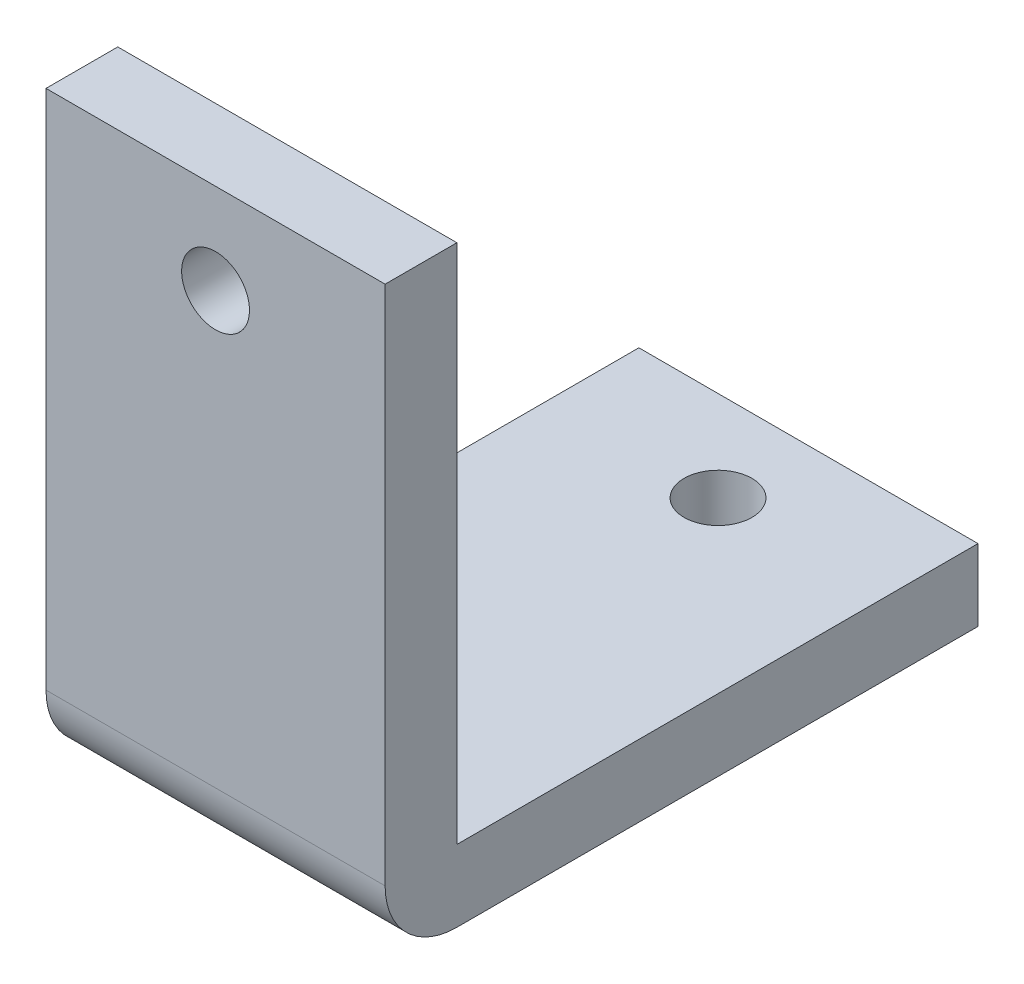
ISO-10303-21;
HEADER;
FILE_DESCRIPTION(('STEP AP214'),'2;1');
FILE_NAME('part.step','',(''),(''),'','','');
FILE_SCHEMA(('AUTOMOTIVE_DESIGN { 1 0 10303 214 1 1 1 1 }'));
ENDSEC;
DATA;
#1=APPLICATION_CONTEXT('core data for automotive mechanical design processes');
#2=APPLICATION_PROTOCOL_DEFINITION('international standard','automotive_design',2000,#1);
#3=PRODUCT_CONTEXT('',#1,'mechanical');
#4=PRODUCT('Part','Part','',(#3));
#5=PRODUCT_RELATED_PRODUCT_CATEGORY('part','',(#4));
#6=PRODUCT_DEFINITION_FORMATION('','',#4);
#7=PRODUCT_DEFINITION_CONTEXT('part definition',#1,'design');
#8=PRODUCT_DEFINITION('design','',#6,#7);
#9=PRODUCT_DEFINITION_SHAPE('','',#8);
#10=(LENGTH_UNIT() NAMED_UNIT(*) SI_UNIT(.MILLI.,.METRE.));
#11=(NAMED_UNIT(*) PLANE_ANGLE_UNIT() SI_UNIT($,.RADIAN.));
#12=(NAMED_UNIT(*) SI_UNIT($,.STERADIAN.) SOLID_ANGLE_UNIT());
#13=UNCERTAINTY_MEASURE_WITH_UNIT(LENGTH_MEASURE(1.E-05),#10,'distance_accuracy_value','');
#14=(GEOMETRIC_REPRESENTATION_CONTEXT(3) GLOBAL_UNCERTAINTY_ASSIGNED_CONTEXT((#13)) GLOBAL_UNIT_ASSIGNED_CONTEXT((#10,
#11,#12)) REPRESENTATION_CONTEXT('',''));
#15=CARTESIAN_POINT('',(0.,0.,0.));
#16=DIRECTION('',(0.,0.,1.));
#17=DIRECTION('',(1.,0.,0.));
#18=AXIS2_PLACEMENT_3D('',#15,#16,#17);
#19=CARTESIAN_POINT('',(15.,23.05,0.));
#20=DIRECTION('',(0.,-1.,0.));
#21=DIRECTION('',(0.,0.,-1.));
#22=AXIS2_PLACEMENT_3D('',#19,#20,#21);
#23=PLANE('',#22);
#24=DIRECTION('',(0.,0.,1.));
#25=VECTOR('',#24,1.);
#26=CARTESIAN_POINT('',(0.,23.05,0.));
#27=LINE('',#26,#25);
#28=CARTESIAN_POINT('',(0.,23.05,0.));
#29=VERTEX_POINT('',#28);
#30=CARTESIAN_POINT('',(0.,23.05,3.175));
#31=VERTEX_POINT('',#30);
#32=EDGE_CURVE('E118',#29,#31,#27,.T.);
#33=ORIENTED_EDGE('',*,*,#32,.T.);
#34=DIRECTION('',(-1.,0.,0.));
#35=VECTOR('',#34,1.);
#36=CARTESIAN_POINT('',(15.,23.05,3.175));
#37=LINE('',#36,#35);
#38=CARTESIAN_POINT('',(15.,23.05,3.175));
#39=VERTEX_POINT('',#38);
#40=EDGE_CURVE('E99',#39,#31,#37,.T.);
#41=ORIENTED_EDGE('',*,*,#40,.F.);
#42=DIRECTION('',(0.,0.,1.));
#43=VECTOR('',#42,1.);
#44=CARTESIAN_POINT('',(15.,23.05,0.));
#45=LINE('',#44,#43);
#46=CARTESIAN_POINT('',(15.,23.05,0.));
#47=VERTEX_POINT('',#46);
#48=EDGE_CURVE('E105',#47,#39,#45,.T.);
#49=ORIENTED_EDGE('',*,*,#48,.F.);
#50=DIRECTION('',(-1.,0.,0.));
#51=VECTOR('',#50,1.);
#52=CARTESIAN_POINT('',(15.,23.05,0.));
#53=LINE('',#52,#51);
#54=EDGE_CURVE('E141',#47,#29,#53,.T.);
#55=ORIENTED_EDGE('',*,*,#54,.T.);
#56=EDGE_LOOP('',(#33,#41,#49,#55));
#57=FACE_BOUND('',#56,.T.);
#58=ADVANCED_FACE('F39',(#57),#23,.F.);
#59=CARTESIAN_POINT('',(15.,23.05,3.175));
#60=DIRECTION('',(0.,0.,-1.));
#61=DIRECTION('',(0.,1.,0.));
#62=AXIS2_PLACEMENT_3D('',#59,#60,#61);
#63=PLANE('',#62);
#64=CARTESIAN_POINT('',(7.5,19.05,3.175));
#65=DIRECTION('',(0.,0.,1.));
#66=DIRECTION('',(1.,0.,0.));
#67=AXIS2_PLACEMENT_3D('',#64,#65,#66);
#68=CIRCLE('',#67,1.5);
#69=CARTESIAN_POINT('',(9.,19.05,3.175));
#70=VERTEX_POINT('',#69);
#71=EDGE_CURVE('E174',#70,#70,#68,.T.);
#72=ORIENTED_EDGE('',*,*,#71,.F.);
#73=EDGE_LOOP('',(#72));
#74=FACE_BOUND('',#73,.T.);
#75=DIRECTION('',(0.,-1.,0.));
#76=VECTOR('',#75,1.);
#77=CARTESIAN_POINT('',(0.,23.05,3.175));
#78=LINE('',#77,#76);
#79=CARTESIAN_POINT('',(0.,0.,3.175));
#80=VERTEX_POINT('',#79);
#81=EDGE_CURVE('E155',#31,#80,#78,.T.);
#82=ORIENTED_EDGE('',*,*,#81,.T.);
#83=DIRECTION('',(-1.,0.,0.));
#84=VECTOR('',#83,1.);
#85=CARTESIAN_POINT('',(15.,0.,3.175));
#86=LINE('',#85,#84);
#87=CARTESIAN_POINT('',(15.,0.,3.175));
#88=VERTEX_POINT('',#87);
#89=EDGE_CURVE('E48',#80,#88,#86,.F.);
#90=ORIENTED_EDGE('',*,*,#89,.T.);
#91=DIRECTION('',(0.,-1.,0.));
#92=VECTOR('',#91,1.);
#93=CARTESIAN_POINT('',(15.,23.05,3.175));
#94=LINE('',#93,#92);
#95=EDGE_CURVE('E95',#39,#88,#94,.T.);
#96=ORIENTED_EDGE('',*,*,#95,.F.);
#97=ORIENTED_EDGE('',*,*,#40,.T.);
#98=EDGE_LOOP('',(#82,#90,#96,#97));
#99=FACE_BOUND('',#98,.T.);
#100=ADVANCED_FACE('F97',(#74,#99),#63,.F.);
#101=CARTESIAN_POINT('',(15.,-3.175,3.175));
#102=DIRECTION('',(0.,1.,0.));
#103=DIRECTION('',(0.,0.,1.));
#104=AXIS2_PLACEMENT_3D('',#101,#102,#103);
#105=PLANE('',#104);
#106=CARTESIAN_POINT('',(7.5,-3.175,-19.05));
#107=DIRECTION('',(0.,-1.,0.));
#108=DIRECTION('',(0.,0.,-1.));
#109=AXIS2_PLACEMENT_3D('',#106,#107,#108);
#110=CIRCLE('',#109,1.5);
#111=CARTESIAN_POINT('',(7.5,-3.175,-20.55));
#112=VERTEX_POINT('',#111);
#113=EDGE_CURVE('E182',#112,#112,#110,.T.);
#114=ORIENTED_EDGE('',*,*,#113,.F.);
#115=EDGE_LOOP('',(#114));
#116=FACE_BOUND('',#115,.T.);
#117=DIRECTION('',(0.,0.,-1.));
#118=VECTOR('',#117,1.);
#119=CARTESIAN_POINT('',(15.,-3.175,3.175));
#120=LINE('',#119,#118);
#121=CARTESIAN_POINT('',(15.,-3.175,0.));
#122=VERTEX_POINT('',#121);
#123=CARTESIAN_POINT('',(15.,-3.175,-23.05));
#124=VERTEX_POINT('',#123);
#125=EDGE_CURVE('E104',#122,#124,#120,.T.);
#126=ORIENTED_EDGE('',*,*,#125,.F.);
#127=DIRECTION('',(-1.,0.,0.));
#128=VECTOR('',#127,1.);
#129=CARTESIAN_POINT('',(15.,-3.175,0.));
#130=LINE('',#129,#128);
#131=CARTESIAN_POINT('',(0.,-3.175,0.));
#132=VERTEX_POINT('',#131);
#133=EDGE_CURVE('E120',#122,#132,#130,.T.);
#134=ORIENTED_EDGE('',*,*,#133,.T.);
#135=DIRECTION('',(0.,0.,-1.));
#136=VECTOR('',#135,1.);
#137=CARTESIAN_POINT('',(0.,-3.175,3.175));
#138=LINE('',#137,#136);
#139=CARTESIAN_POINT('',(0.,-3.175,-23.05));
#140=VERTEX_POINT('',#139);
#141=EDGE_CURVE('E152',#132,#140,#138,.T.);
#142=ORIENTED_EDGE('',*,*,#141,.T.);
#143=DIRECTION('',(-1.,0.,0.));
#144=VECTOR('',#143,1.);
#145=CARTESIAN_POINT('',(15.,-3.175,-23.05));
#146=LINE('',#145,#144);
#147=EDGE_CURVE('E121',#124,#140,#146,.T.);
#148=ORIENTED_EDGE('',*,*,#147,.F.);
#149=EDGE_LOOP('',(#126,#134,#142,#148));
#150=FACE_BOUND('',#149,.T.);
#151=ADVANCED_FACE('F189',(#116,#150),#105,.F.);
#152=CARTESIAN_POINT('',(15.,-3.175,-23.05));
#153=DIRECTION('',(0.,0.,1.));
#154=DIRECTION('',(1.,0.,0.));
#155=AXIS2_PLACEMENT_3D('',#152,#153,#154);
#156=PLANE('',#155);
#157=DIRECTION('',(0.,1.,0.));
#158=VECTOR('',#157,1.);
#159=CARTESIAN_POINT('',(0.,-3.175,-23.05));
#160=LINE('',#159,#158);
#161=CARTESIAN_POINT('',(0.,0.,-23.05));
#162=VERTEX_POINT('',#161);
#163=EDGE_CURVE('E149',#140,#162,#160,.T.);
#164=ORIENTED_EDGE('',*,*,#163,.T.);
#165=DIRECTION('',(-1.,0.,0.));
#166=VECTOR('',#165,1.);
#167=CARTESIAN_POINT('',(15.,0.,-23.05));
#168=LINE('',#167,#166);
#169=CARTESIAN_POINT('',(15.,0.,-23.05));
#170=VERTEX_POINT('',#169);
#171=EDGE_CURVE('E128',#170,#162,#168,.T.);
#172=ORIENTED_EDGE('',*,*,#171,.F.);
#173=DIRECTION('',(0.,1.,0.));
#174=VECTOR('',#173,1.);
#175=CARTESIAN_POINT('',(15.,-3.175,-23.05));
#176=LINE('',#175,#174);
#177=EDGE_CURVE('E166',#124,#170,#176,.T.);
#178=ORIENTED_EDGE('',*,*,#177,.F.);
#179=ORIENTED_EDGE('',*,*,#147,.T.);
#180=EDGE_LOOP('',(#164,#172,#178,#179));
#181=FACE_BOUND('',#180,.T.);
#182=ADVANCED_FACE('F192',(#181),#156,.F.);
#183=CARTESIAN_POINT('',(15.,0.,-23.05));
#184=DIRECTION('',(0.,-1.,0.));
#185=DIRECTION('',(0.,0.,-1.));
#186=AXIS2_PLACEMENT_3D('',#183,#184,#185);
#187=PLANE('',#186);
#188=CARTESIAN_POINT('',(7.5,0.,-19.05));
#189=DIRECTION('',(0.,-1.,0.));
#190=DIRECTION('',(0.,0.,-1.));
#191=AXIS2_PLACEMENT_3D('',#188,#189,#190);
#192=CIRCLE('',#191,1.5);
#193=CARTESIAN_POINT('',(7.5,0.,-20.55));
#194=VERTEX_POINT('',#193);
#195=EDGE_CURVE('E178',#194,#194,#192,.F.);
#196=ORIENTED_EDGE('',*,*,#195,.F.);
#197=EDGE_LOOP('',(#196));
#198=FACE_BOUND('',#197,.T.);
#199=DIRECTION('',(0.,0.,1.));
#200=VECTOR('',#199,1.);
#201=CARTESIAN_POINT('',(0.,0.,-23.05));
#202=LINE('',#201,#200);
#203=CARTESIAN_POINT('',(0.,0.,0.));
#204=VERTEX_POINT('',#203);
#205=EDGE_CURVE('E146',#162,#204,#202,.T.);
#206=ORIENTED_EDGE('',*,*,#205,.T.);
#207=DIRECTION('',(-1.,0.,0.));
#208=VECTOR('',#207,1.);
#209=CARTESIAN_POINT('',(15.,0.,0.));
#210=LINE('',#209,#208);
#211=CARTESIAN_POINT('',(15.,0.,0.));
#212=VERTEX_POINT('',#211);
#213=EDGE_CURVE('E137',#212,#204,#210,.T.);
#214=ORIENTED_EDGE('',*,*,#213,.F.);
#215=DIRECTION('',(0.,0.,1.));
#216=VECTOR('',#215,1.);
#217=CARTESIAN_POINT('',(15.,0.,-23.05));
#218=LINE('',#217,#216);
#219=EDGE_CURVE('E163',#170,#212,#218,.T.);
#220=ORIENTED_EDGE('',*,*,#219,.F.);
#221=ORIENTED_EDGE('',*,*,#171,.T.);
#222=EDGE_LOOP('',(#206,#214,#220,#221));
#223=FACE_BOUND('',#222,.T.);
#224=ADVANCED_FACE('F218',(#198,#223),#187,.F.);
#225=CARTESIAN_POINT('',(15.,0.,0.));
#226=DIRECTION('',(0.,0.,1.));
#227=DIRECTION('',(1.,0.,0.));
#228=AXIS2_PLACEMENT_3D('',#225,#226,#227);
#229=PLANE('',#228);
#230=CARTESIAN_POINT('',(7.5,19.05,0.));
#231=DIRECTION('',(0.,0.,1.));
#232=DIRECTION('',(1.,0.,0.));
#233=AXIS2_PLACEMENT_3D('',#230,#231,#232);
#234=CIRCLE('',#233,1.5);
#235=CARTESIAN_POINT('',(9.,19.05,0.));
#236=VERTEX_POINT('',#235);
#237=EDGE_CURVE('E160',#236,#236,#234,.F.);
#238=ORIENTED_EDGE('',*,*,#237,.F.);
#239=EDGE_LOOP('',(#238));
#240=FACE_BOUND('',#239,.T.);
#241=DIRECTION('',(0.,1.,0.));
#242=VECTOR('',#241,1.);
#243=CARTESIAN_POINT('',(0.,0.,0.));
#244=LINE('',#243,#242);
#245=EDGE_CURVE('E115',#204,#29,#244,.T.);
#246=ORIENTED_EDGE('',*,*,#245,.T.);
#247=ORIENTED_EDGE('',*,*,#54,.F.);
#248=DIRECTION('',(0.,1.,0.));
#249=VECTOR('',#248,1.);
#250=CARTESIAN_POINT('',(15.,0.,0.));
#251=LINE('',#250,#249);
#252=EDGE_CURVE('E110',#212,#47,#251,.T.);
#253=ORIENTED_EDGE('',*,*,#252,.F.);
#254=ORIENTED_EDGE('',*,*,#213,.T.);
#255=EDGE_LOOP('',(#246,#247,#253,#254));
#256=FACE_BOUND('',#255,.T.);
#257=ADVANCED_FACE('F222',(#240,#256),#229,.F.);
#258=CARTESIAN_POINT('',(15.,0.,0.));
#259=DIRECTION('',(1.,0.,0.));
#260=DIRECTION('',(0.,0.,-1.));
#261=AXIS2_PLACEMENT_3D('',#258,#259,#260);
#262=PLANE('',#261);
#263=ORIENTED_EDGE('',*,*,#95,.T.);
#264=CARTESIAN_POINT('',(15.,0.,0.));
#265=DIRECTION('',(1.,0.,0.));
#266=DIRECTION('',(0.,0.,-1.));
#267=AXIS2_PLACEMENT_3D('',#264,#265,#266);
#268=CIRCLE('',#267,3.175);
#269=EDGE_CURVE('E11',#88,#122,#268,.T.);
#270=ORIENTED_EDGE('',*,*,#269,.T.);
#271=ORIENTED_EDGE('',*,*,#125,.T.);
#272=ORIENTED_EDGE('',*,*,#177,.T.);
#273=ORIENTED_EDGE('',*,*,#219,.T.);
#274=ORIENTED_EDGE('',*,*,#252,.T.);
#275=ORIENTED_EDGE('',*,*,#48,.T.);
#276=EDGE_LOOP('',(#263,#270,#271,#272,#273,#274,#275));
#277=FACE_BOUND('',#276,.T.);
#278=ADVANCED_FACE('F108',(#277),#262,.T.);
#279=CARTESIAN_POINT('',(0.,0.,0.));
#280=DIRECTION('',(1.,0.,0.));
#281=DIRECTION('',(0.,0.,-1.));
#282=AXIS2_PLACEMENT_3D('',#279,#280,#281);
#283=PLANE('',#282);
#284=ORIENTED_EDGE('',*,*,#141,.F.);
#285=CARTESIAN_POINT('',(0.,0.,0.));
#286=DIRECTION('',(1.,0.,0.));
#287=DIRECTION('',(0.,0.,-1.));
#288=AXIS2_PLACEMENT_3D('',#285,#286,#287);
#289=CIRCLE('',#288,3.175);
#290=EDGE_CURVE('E62',#132,#80,#289,.F.);
#291=ORIENTED_EDGE('',*,*,#290,.T.);
#292=ORIENTED_EDGE('',*,*,#81,.F.);
#293=ORIENTED_EDGE('',*,*,#32,.F.);
#294=ORIENTED_EDGE('',*,*,#245,.F.);
#295=ORIENTED_EDGE('',*,*,#205,.F.);
#296=ORIENTED_EDGE('',*,*,#163,.F.);
#297=EDGE_LOOP('',(#284,#291,#292,#293,#294,#295,#296));
#298=FACE_BOUND('',#297,.T.);
#299=ADVANCED_FACE('F201',(#298),#283,.F.);
#300=CARTESIAN_POINT('',(15.,0.,0.));
#301=DIRECTION('',(-1.,0.,0.));
#302=DIRECTION('',(0.,0.,1.));
#303=AXIS2_PLACEMENT_3D('',#300,#301,#302);
#304=CYLINDRICAL_SURFACE('',#303,3.175);
#305=ORIENTED_EDGE('',*,*,#269,.F.);
#306=ORIENTED_EDGE('',*,*,#89,.F.);
#307=ORIENTED_EDGE('',*,*,#290,.F.);
#308=ORIENTED_EDGE('',*,*,#133,.F.);
#309=EDGE_LOOP('',(#305,#306,#307,#308));
#310=FACE_BOUND('',#309,.T.);
#311=ADVANCED_FACE('F41',(#310),#304,.T.);
#312=CARTESIAN_POINT('',(7.5,19.05,-4.24264068711929));
#313=DIRECTION('',(0.,0.,1.));
#314=DIRECTION('',(1.,0.,0.));
#315=AXIS2_PLACEMENT_3D('',#312,#313,#314);
#316=CYLINDRICAL_SURFACE('',#315,1.5);
#317=ORIENTED_EDGE('',*,*,#237,.T.);
#318=EDGE_LOOP('',(#317));
#319=FACE_BOUND('',#318,.T.);
#320=ORIENTED_EDGE('',*,*,#71,.T.);
#321=EDGE_LOOP('',(#320));
#322=FACE_BOUND('',#321,.T.);
#323=ADVANCED_FACE('F200',(#319,#322),#316,.F.);
#324=CARTESIAN_POINT('',(7.5,4.24264068711929,-19.05));
#325=DIRECTION('',(0.,-1.,0.));
#326=DIRECTION('',(0.,0.,-1.));
#327=AXIS2_PLACEMENT_3D('',#324,#325,#326);
#328=CYLINDRICAL_SURFACE('',#327,1.5);
#329=ORIENTED_EDGE('',*,*,#195,.T.);
#330=EDGE_LOOP('',(#329));
#331=FACE_BOUND('',#330,.T.);
#332=ORIENTED_EDGE('',*,*,#113,.T.);
#333=EDGE_LOOP('',(#332));
#334=FACE_BOUND('',#333,.T.);
#335=ADVANCED_FACE('F187',(#331,#334),#328,.F.);
#336=CLOSED_SHELL('',(#58,#100,#151,#182,#224,#257,#278,#299,#311,#323,#335));
#337=MANIFOLD_SOLID_BREP('B2',#336);
#338=ADVANCED_BREP_SHAPE_REPRESENTATION('',(#18,#337),#14);
#339=SHAPE_DEFINITION_REPRESENTATION(#9,#338);
ENDSEC;
END-ISO-10303-21;
